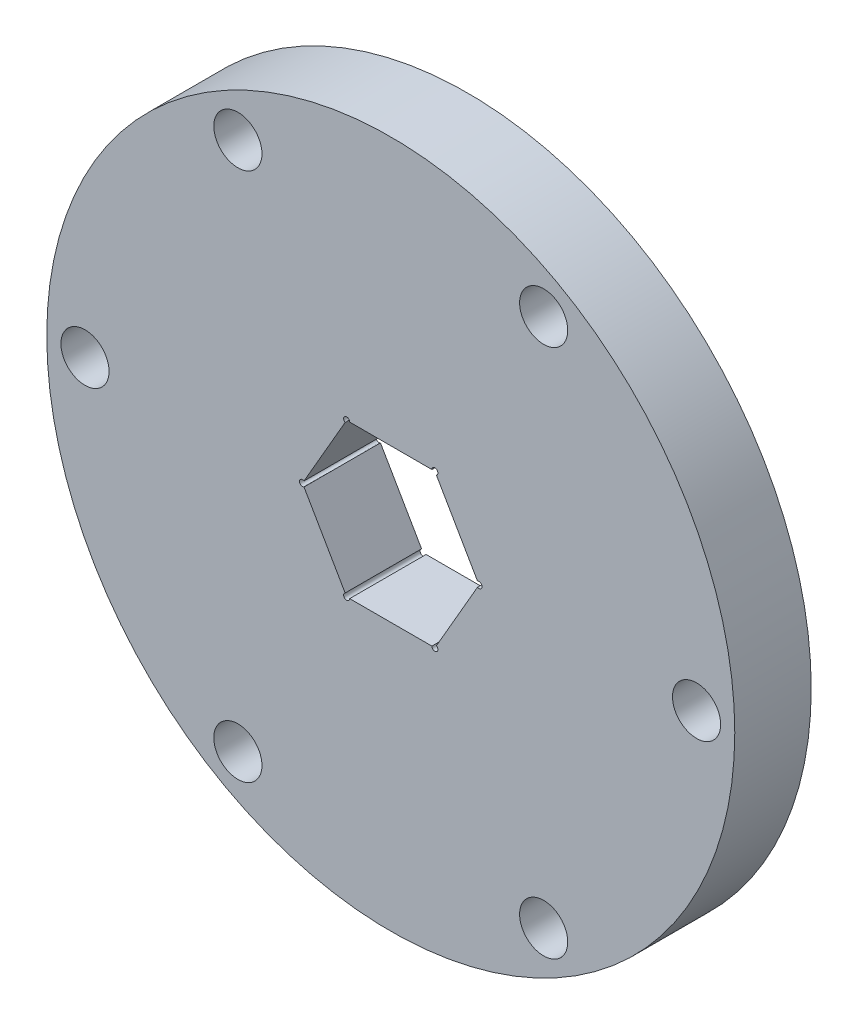
ISO-10303-21;
HEADER;
FILE_DESCRIPTION(('STEP AP214'),'2;1');
FILE_NAME('part.step','',(''),(''),'','','');
FILE_SCHEMA(('AUTOMOTIVE_DESIGN { 1 0 10303 214 1 1 1 1 }'));
ENDSEC;
DATA;
#1=APPLICATION_CONTEXT('core data for automotive mechanical design processes');
#2=APPLICATION_PROTOCOL_DEFINITION('international standard','automotive_design',2000,#1);
#3=PRODUCT_CONTEXT('',#1,'mechanical');
#4=PRODUCT('Part','Part','',(#3));
#5=PRODUCT_RELATED_PRODUCT_CATEGORY('part','',(#4));
#6=PRODUCT_DEFINITION_FORMATION('','',#4);
#7=PRODUCT_DEFINITION_CONTEXT('part definition',#1,'design');
#8=PRODUCT_DEFINITION('design','',#6,#7);
#9=PRODUCT_DEFINITION_SHAPE('','',#8);
#10=(LENGTH_UNIT() NAMED_UNIT(*) SI_UNIT(.MILLI.,.METRE.));
#11=(NAMED_UNIT(*) PLANE_ANGLE_UNIT() SI_UNIT($,.RADIAN.));
#12=(NAMED_UNIT(*) SI_UNIT($,.STERADIAN.) SOLID_ANGLE_UNIT());
#13=UNCERTAINTY_MEASURE_WITH_UNIT(LENGTH_MEASURE(1.E-05),#10,'distance_accuracy_value','');
#14=(GEOMETRIC_REPRESENTATION_CONTEXT(3) GLOBAL_UNCERTAINTY_ASSIGNED_CONTEXT((#13)) GLOBAL_UNIT_ASSIGNED_CONTEXT((#10,
#11,#12)) REPRESENTATION_CONTEXT('',''));
#15=CARTESIAN_POINT('',(0.,0.,0.));
#16=DIRECTION('',(0.,0.,1.));
#17=DIRECTION('',(1.,0.,0.));
#18=AXIS2_PLACEMENT_3D('',#15,#16,#17);
#19=CARTESIAN_POINT('',(3.66617420935412,-6.35,0.));
#20=DIRECTION('',(0.866025403784439,-0.5,0.));
#21=DIRECTION('',(0.5,0.866025403784439,0.));
#22=AXIS2_PLACEMENT_3D('',#19,#20,#21);
#23=PLANE('',#22);
#24=DIRECTION('',(0.5,0.866025403784439,0.));
#25=VECTOR('',#24,1.);
#26=CARTESIAN_POINT('',(3.66617420935412,-6.35,0.));
#27=LINE('',#26,#25);
#28=CARTESIAN_POINT('',(3.7911742093541,-6.13349364905393,0.));
#29=VERTEX_POINT('',#28);
#30=CARTESIAN_POINT('',(7.20734841870823,-0.216506350946134,0.));
#31=VERTEX_POINT('',#30);
#32=EDGE_CURVE('E169',#29,#31,#27,.T.);
#33=ORIENTED_EDGE('',*,*,#32,.F.);
#34=DIRECTION('',(0.,0.,1.));
#35=VECTOR('',#34,1.);
#36=CARTESIAN_POINT('',(3.7911742093541,-6.13349364905393,-6.35));
#37=LINE('',#36,#35);
#38=CARTESIAN_POINT('',(3.7911742093541,-6.13349364905393,6.35));
#39=VERTEX_POINT('',#38);
#40=EDGE_CURVE('E253',#29,#39,#37,.T.);
#41=ORIENTED_EDGE('',*,*,#40,.T.);
#42=DIRECTION('',(-0.5,-0.866025403784439,0.));
#43=VECTOR('',#42,1.);
#44=CARTESIAN_POINT('',(3.66617420935412,-6.35,6.35));
#45=LINE('',#44,#43);
#46=CARTESIAN_POINT('',(7.20734841870823,-0.216506350946135,6.35));
#47=VERTEX_POINT('',#46);
#48=EDGE_CURVE('E162',#47,#39,#45,.T.);
#49=ORIENTED_EDGE('',*,*,#48,.F.);
#50=DIRECTION('',(0.,0.,1.));
#51=VECTOR('',#50,1.);
#52=CARTESIAN_POINT('',(7.20734841870823,-0.216506350946135,-6.35));
#53=LINE('',#52,#51);
#54=EDGE_CURVE('E254',#47,#31,#53,.F.);
#55=ORIENTED_EDGE('',*,*,#54,.T.);
#56=EDGE_LOOP('',(#33,#41,#49,#55));
#57=FACE_BOUND('',#56,.T.);
#58=ADVANCED_FACE('F39',(#57),#23,.F.);
#59=CARTESIAN_POINT('',(-3.66617420935413,-6.35,0.));
#60=DIRECTION('',(0.,-1.,0.));
#61=DIRECTION('',(1.,0.,0.));
#62=AXIS2_PLACEMENT_3D('',#59,#60,#61);
#63=PLANE('',#62);
#64=DIRECTION('',(1.,0.,0.));
#65=VECTOR('',#64,1.);
#66=CARTESIAN_POINT('',(-3.66617420935413,-6.35,0.));
#67=LINE('',#66,#65);
#68=CARTESIAN_POINT('',(-3.41617420935419,-6.35,0.));
#69=VERTEX_POINT('',#68);
#70=CARTESIAN_POINT('',(3.41617420935408,-6.35,0.));
#71=VERTEX_POINT('',#70);
#72=EDGE_CURVE('E215',#69,#71,#67,.T.);
#73=ORIENTED_EDGE('',*,*,#72,.F.);
#74=DIRECTION('',(0.,0.,1.));
#75=VECTOR('',#74,1.);
#76=CARTESIAN_POINT('',(-3.41617420935419,-6.35,-6.35));
#77=LINE('',#76,#75);
#78=CARTESIAN_POINT('',(-3.41617420935419,-6.35,6.35));
#79=VERTEX_POINT('',#78);
#80=EDGE_CURVE('E249',#69,#79,#77,.T.);
#81=ORIENTED_EDGE('',*,*,#80,.T.);
#82=DIRECTION('',(-1.,0.,0.));
#83=VECTOR('',#82,1.);
#84=CARTESIAN_POINT('',(-3.66617420935413,-6.35,6.35));
#85=LINE('',#84,#83);
#86=CARTESIAN_POINT('',(3.41617420935408,-6.35,6.35));
#87=VERTEX_POINT('',#86);
#88=EDGE_CURVE('E159',#87,#79,#85,.T.);
#89=ORIENTED_EDGE('',*,*,#88,.F.);
#90=DIRECTION('',(0.,0.,1.));
#91=VECTOR('',#90,1.);
#92=CARTESIAN_POINT('',(3.41617420935408,-6.35,-6.35));
#93=LINE('',#92,#91);
#94=EDGE_CURVE('E250',#87,#71,#93,.F.);
#95=ORIENTED_EDGE('',*,*,#94,.T.);
#96=EDGE_LOOP('',(#73,#81,#89,#95));
#97=FACE_BOUND('',#96,.T.);
#98=ADVANCED_FACE('F247',(#97),#63,.F.);
#99=CARTESIAN_POINT('',(-7.33234841870825,0.,0.));
#100=DIRECTION('',(-0.866025403784439,-0.5,0.));
#101=DIRECTION('',(0.5,-0.866025403784439,0.));
#102=AXIS2_PLACEMENT_3D('',#99,#100,#101);
#103=PLANE('',#102);
#104=DIRECTION('',(0.5,-0.866025403784439,0.));
#105=VECTOR('',#104,1.);
#106=CARTESIAN_POINT('',(-7.33234841870825,0.,0.));
#107=LINE('',#106,#105);
#108=CARTESIAN_POINT('',(-7.20734841870829,-0.216506350946045,0.));
#109=VERTEX_POINT('',#108);
#110=CARTESIAN_POINT('',(-3.79117420935416,-6.13349364905384,0.));
#111=VERTEX_POINT('',#110);
#112=EDGE_CURVE('E212',#109,#111,#107,.T.);
#113=ORIENTED_EDGE('',*,*,#112,.F.);
#114=DIRECTION('',(0.,0.,1.));
#115=VECTOR('',#114,1.);
#116=CARTESIAN_POINT('',(-7.20734841870829,-0.216506350946045,-6.35));
#117=LINE('',#116,#115);
#118=CARTESIAN_POINT('',(-7.20734841870829,-0.216506350946045,6.35));
#119=VERTEX_POINT('',#118);
#120=EDGE_CURVE('E54',#109,#119,#117,.T.);
#121=ORIENTED_EDGE('',*,*,#120,.T.);
#122=DIRECTION('',(-0.5,0.866025403784439,0.));
#123=VECTOR('',#122,1.);
#124=CARTESIAN_POINT('',(-7.33234841870825,0.,6.35));
#125=LINE('',#124,#123);
#126=CARTESIAN_POINT('',(-3.79117420935416,-6.13349364905384,6.35));
#127=VERTEX_POINT('',#126);
#128=EDGE_CURVE('E151',#127,#119,#125,.T.);
#129=ORIENTED_EDGE('',*,*,#128,.F.);
#130=DIRECTION('',(0.,0.,1.));
#131=VECTOR('',#130,1.);
#132=CARTESIAN_POINT('',(-3.79117420935416,-6.13349364905384,-6.35));
#133=LINE('',#132,#131);
#134=EDGE_CURVE('E257',#127,#111,#133,.F.);
#135=ORIENTED_EDGE('',*,*,#134,.T.);
#136=EDGE_LOOP('',(#113,#121,#129,#135));
#137=FACE_BOUND('',#136,.T.);
#138=ADVANCED_FACE('F296',(#137),#103,.F.);
#139=CARTESIAN_POINT('',(-3.66617420935412,6.35,0.));
#140=DIRECTION('',(-0.866025403784439,0.5,0.));
#141=DIRECTION('',(-0.5,-0.866025403784439,0.));
#142=AXIS2_PLACEMENT_3D('',#139,#140,#141);
#143=PLANE('',#142);
#144=DIRECTION('',(0.5,0.866025403784439,0.));
#145=VECTOR('',#144,1.);
#146=CARTESIAN_POINT('',(-3.66617420935412,6.35,6.35));
#147=LINE('',#146,#145);
#148=CARTESIAN_POINT('',(-7.20734841870821,0.216506350946176,6.35));
#149=VERTEX_POINT('',#148);
#150=CARTESIAN_POINT('',(-3.79117420935412,6.13349364905389,6.35));
#151=VERTEX_POINT('',#150);
#152=EDGE_CURVE('E144',#149,#151,#147,.T.);
#153=ORIENTED_EDGE('',*,*,#152,.F.);
#154=DIRECTION('',(0.,0.,1.));
#155=VECTOR('',#154,1.);
#156=CARTESIAN_POINT('',(-7.20734841870821,0.216506350946176,-6.35));
#157=LINE('',#156,#155);
#158=CARTESIAN_POINT('',(-7.20734841870821,0.216506350946176,0.));
#159=VERTEX_POINT('',#158);
#160=EDGE_CURVE('E153',#149,#159,#157,.F.);
#161=ORIENTED_EDGE('',*,*,#160,.T.);
#162=DIRECTION('',(-0.5,-0.866025403784439,0.));
#163=VECTOR('',#162,1.);
#164=CARTESIAN_POINT('',(-3.66617420935412,6.35,0.));
#165=LINE('',#164,#163);
#166=CARTESIAN_POINT('',(-3.79117420935412,6.13349364905389,0.));
#167=VERTEX_POINT('',#166);
#168=EDGE_CURVE('E209',#167,#159,#165,.T.);
#169=ORIENTED_EDGE('',*,*,#168,.F.);
#170=DIRECTION('',(0.,0.,1.));
#171=VECTOR('',#170,1.);
#172=CARTESIAN_POINT('',(-3.79117420935412,6.13349364905389,-6.35));
#173=LINE('',#172,#171);
#174=EDGE_CURVE('E61',#167,#151,#173,.T.);
#175=ORIENTED_EDGE('',*,*,#174,.T.);
#176=EDGE_LOOP('',(#153,#161,#169,#175));
#177=FACE_BOUND('',#176,.T.);
#178=ADVANCED_FACE('F268',(#177),#143,.F.);
#179=CARTESIAN_POINT('',(3.66617420935412,6.35,0.));
#180=DIRECTION('',(0.,1.,0.));
#181=DIRECTION('',(-1.,0.,0.));
#182=AXIS2_PLACEMENT_3D('',#179,#180,#181);
#183=PLANE('',#182);
#184=DIRECTION('',(-1.,0.,0.));
#185=VECTOR('',#184,1.);
#186=CARTESIAN_POINT('',(3.66617420935412,6.35,0.));
#187=LINE('',#186,#185);
#188=CARTESIAN_POINT('',(3.41617420935414,6.35,0.));
#189=VERTEX_POINT('',#188);
#190=CARTESIAN_POINT('',(-3.41617420935412,6.35,0.));
#191=VERTEX_POINT('',#190);
#192=EDGE_CURVE('E207',#189,#191,#187,.T.);
#193=ORIENTED_EDGE('',*,*,#192,.F.);
#194=DIRECTION('',(0.,0.,1.));
#195=VECTOR('',#194,1.);
#196=CARTESIAN_POINT('',(3.41617420935414,6.35,-6.35));
#197=LINE('',#196,#195);
#198=CARTESIAN_POINT('',(3.41617420935414,6.35,6.35));
#199=VERTEX_POINT('',#198);
#200=EDGE_CURVE('E149',#189,#199,#197,.T.);
#201=ORIENTED_EDGE('',*,*,#200,.T.);
#202=DIRECTION('',(1.,0.,0.));
#203=VECTOR('',#202,1.);
#204=CARTESIAN_POINT('',(3.66617420935412,6.35,6.35));
#205=LINE('',#204,#203);
#206=CARTESIAN_POINT('',(-3.41617420935412,6.35,6.35));
#207=VERTEX_POINT('',#206);
#208=EDGE_CURVE('E142',#207,#199,#205,.T.);
#209=ORIENTED_EDGE('',*,*,#208,.F.);
#210=DIRECTION('',(0.,0.,1.));
#211=VECTOR('',#210,1.);
#212=CARTESIAN_POINT('',(-3.41617420935412,6.35,-6.35));
#213=LINE('',#212,#211);
#214=EDGE_CURVE('E125',#207,#191,#213,.F.);
#215=ORIENTED_EDGE('',*,*,#214,.T.);
#216=EDGE_LOOP('',(#193,#201,#209,#215));
#217=FACE_BOUND('',#216,.T.);
#218=ADVANCED_FACE('F148',(#217),#183,.F.);
#219=CARTESIAN_POINT('',(7.33234841870824,0.,0.));
#220=DIRECTION('',(0.866025403784439,0.5,0.));
#221=DIRECTION('',(-0.5,0.866025403784439,0.));
#222=AXIS2_PLACEMENT_3D('',#219,#220,#221);
#223=PLANE('',#222);
#224=DIRECTION('',(-0.5,0.866025403784439,0.));
#225=VECTOR('',#224,1.);
#226=CARTESIAN_POINT('',(7.33234841870824,0.,0.));
#227=LINE('',#226,#225);
#228=CARTESIAN_POINT('',(7.20734841870826,0.216506350946081,0.));
#229=VERTEX_POINT('',#228);
#230=CARTESIAN_POINT('',(3.79117420935413,6.13349364905388,0.));
#231=VERTEX_POINT('',#230);
#232=EDGE_CURVE('E204',#229,#231,#227,.T.);
#233=ORIENTED_EDGE('',*,*,#232,.F.);
#234=DIRECTION('',(0.,0.,1.));
#235=VECTOR('',#234,1.);
#236=CARTESIAN_POINT('',(7.20734841870826,0.216506350946081,-6.35));
#237=LINE('',#236,#235);
#238=CARTESIAN_POINT('',(7.20734841870826,0.216506350946081,6.35));
#239=VERTEX_POINT('',#238);
#240=EDGE_CURVE('E260',#229,#239,#237,.T.);
#241=ORIENTED_EDGE('',*,*,#240,.T.);
#242=DIRECTION('',(0.5,-0.866025403784439,0.));
#243=VECTOR('',#242,1.);
#244=CARTESIAN_POINT('',(7.33234841870824,0.,6.35));
#245=LINE('',#244,#243);
#246=CARTESIAN_POINT('',(3.79117420935413,6.13349364905388,6.35));
#247=VERTEX_POINT('',#246);
#248=EDGE_CURVE('E222',#247,#239,#245,.T.);
#249=ORIENTED_EDGE('',*,*,#248,.F.);
#250=DIRECTION('',(0.,0.,1.));
#251=VECTOR('',#250,1.);
#252=CARTESIAN_POINT('',(3.79117420935413,6.13349364905388,-6.35));
#253=LINE('',#252,#251);
#254=EDGE_CURVE('E273',#247,#231,#253,.F.);
#255=ORIENTED_EDGE('',*,*,#254,.T.);
#256=EDGE_LOOP('',(#233,#241,#249,#255));
#257=FACE_BOUND('',#256,.T.);
#258=ADVANCED_FACE('F276',(#257),#223,.F.);
#259=CARTESIAN_POINT('',(0.,0.,6.35));
#260=DIRECTION('',(0.,0.,-1.));
#261=DIRECTION('',(-1.,0.,0.));
#262=AXIS2_PLACEMENT_3D('',#259,#260,#261);
#263=CYLINDRICAL_SURFACE('',#262,28.575);
#264=CARTESIAN_POINT('',(0.,0.,6.35));
#265=DIRECTION('',(0.,0.,1.));
#266=DIRECTION('',(1.,0.,0.));
#267=AXIS2_PLACEMENT_3D('',#264,#265,#266);
#268=CIRCLE('',#267,28.575);
#269=CARTESIAN_POINT('',(28.575,0.,6.35));
#270=VERTEX_POINT('',#269);
#271=EDGE_CURVE('E219',#270,#270,#268,.T.);
#272=ORIENTED_EDGE('',*,*,#271,.F.);
#273=EDGE_LOOP('',(#272));
#274=FACE_BOUND('',#273,.T.);
#275=CARTESIAN_POINT('',(0.,0.,0.));
#276=DIRECTION('',(0.,0.,1.));
#277=DIRECTION('',(1.,0.,0.));
#278=AXIS2_PLACEMENT_3D('',#275,#276,#277);
#279=CIRCLE('',#278,28.575);
#280=CARTESIAN_POINT('',(28.575,0.,0.));
#281=VERTEX_POINT('',#280);
#282=EDGE_CURVE('E218',#281,#281,#279,.T.);
#283=ORIENTED_EDGE('',*,*,#282,.T.);
#284=EDGE_LOOP('',(#283));
#285=FACE_BOUND('',#284,.T.);
#286=ADVANCED_FACE('F41',(#274,#285),#263,.T.);
#287=CARTESIAN_POINT('',(0.,0.,6.35));
#288=DIRECTION('',(0.,0.,1.));
#289=DIRECTION('',(1.,0.,0.));
#290=AXIS2_PLACEMENT_3D('',#287,#288,#289);
#291=PLANE('',#290);
#292=CARTESIAN_POINT('',(-7.33234841870825,0.,6.35));
#293=DIRECTION('',(0.,0.,1.));
#294=DIRECTION('',(1.,0.,0.));
#295=AXIS2_PLACEMENT_3D('',#292,#293,#294);
#296=CIRCLE('',#295,0.25);
#297=EDGE_CURVE('E292',#149,#119,#296,.T.);
#298=ORIENTED_EDGE('',*,*,#297,.F.);
#299=ORIENTED_EDGE('',*,*,#152,.T.);
#300=CARTESIAN_POINT('',(-3.66617420935412,6.35,6.35));
#301=DIRECTION('',(0.,0.,1.));
#302=DIRECTION('',(1.,0.,0.));
#303=AXIS2_PLACEMENT_3D('',#300,#301,#302);
#304=CIRCLE('',#303,0.25);
#305=EDGE_CURVE('E128',#207,#151,#304,.T.);
#306=ORIENTED_EDGE('',*,*,#305,.F.);
#307=ORIENTED_EDGE('',*,*,#208,.T.);
#308=CARTESIAN_POINT('',(3.66617420935414,6.34999999999999,6.35));
#309=DIRECTION('',(0.,0.,1.));
#310=DIRECTION('',(1.,0.,0.));
#311=AXIS2_PLACEMENT_3D('',#308,#309,#310);
#312=CIRCLE('',#311,0.25);
#313=EDGE_CURVE('E145',#247,#199,#312,.T.);
#314=ORIENTED_EDGE('',*,*,#313,.F.);
#315=ORIENTED_EDGE('',*,*,#248,.T.);
#316=CARTESIAN_POINT('',(7.33234841870825,0.,6.35));
#317=DIRECTION('',(0.,0.,1.));
#318=DIRECTION('',(1.,0.,0.));
#319=AXIS2_PLACEMENT_3D('',#316,#317,#318);
#320=CIRCLE('',#319,0.25);
#321=EDGE_CURVE('E283',#47,#239,#320,.T.);
#322=ORIENTED_EDGE('',*,*,#321,.F.);
#323=ORIENTED_EDGE('',*,*,#48,.T.);
#324=CARTESIAN_POINT('',(3.66617420935408,-6.35000000000003,6.35));
#325=DIRECTION('',(0.,0.,1.));
#326=DIRECTION('',(1.,0.,0.));
#327=AXIS2_PLACEMENT_3D('',#324,#325,#326);
#328=CIRCLE('',#327,0.25);
#329=EDGE_CURVE('E286',#87,#39,#328,.T.);
#330=ORIENTED_EDGE('',*,*,#329,.F.);
#331=ORIENTED_EDGE('',*,*,#88,.T.);
#332=CARTESIAN_POINT('',(-3.66617420935419,-6.34999999999997,6.35));
#333=DIRECTION('',(0.,0.,1.));
#334=DIRECTION('',(1.,0.,0.));
#335=AXIS2_PLACEMENT_3D('',#332,#333,#334);
#336=CIRCLE('',#335,0.249999999999999);
#337=EDGE_CURVE('E290',#127,#79,#336,.T.);
#338=ORIENTED_EDGE('',*,*,#337,.F.);
#339=ORIENTED_EDGE('',*,*,#128,.T.);
#340=EDGE_LOOP('',(#298,#299,#306,#307,#314,#315,#322,#323,#330,#331,#338,#339));
#341=FACE_BOUND('',#340,.T.);
#342=CARTESIAN_POINT('',(25.4,0.,6.35));
#343=DIRECTION('',(0.,0.,1.));
#344=DIRECTION('',(1.,0.,0.));
#345=AXIS2_PLACEMENT_3D('',#342,#343,#344);
#346=CIRCLE('',#345,2.);
#347=CARTESIAN_POINT('',(27.4,0.,6.35));
#348=VERTEX_POINT('',#347);
#349=EDGE_CURVE('E170',#348,#348,#346,.T.);
#350=ORIENTED_EDGE('',*,*,#349,.F.);
#351=EDGE_LOOP('',(#350));
#352=FACE_BOUND('',#351,.T.);
#353=CARTESIAN_POINT('',(12.7000000000003,21.9970452561246,6.35));
#354=DIRECTION('',(0.,0.,1.));
#355=DIRECTION('',(1.,0.,0.));
#356=AXIS2_PLACEMENT_3D('',#353,#354,#355);
#357=CIRCLE('',#356,2.);
#358=CARTESIAN_POINT('',(14.7000000000003,21.9970452561246,6.35));
#359=VERTEX_POINT('',#358);
#360=EDGE_CURVE('E174',#359,#359,#357,.T.);
#361=ORIENTED_EDGE('',*,*,#360,.F.);
#362=EDGE_LOOP('',(#361));
#363=FACE_BOUND('',#362,.T.);
#364=CARTESIAN_POINT('',(-12.6999999999998,21.9970452561249,6.35));
#365=DIRECTION('',(0.,0.,1.));
#366=DIRECTION('',(1.,0.,0.));
#367=AXIS2_PLACEMENT_3D('',#364,#365,#366);
#368=CIRCLE('',#367,2.);
#369=CARTESIAN_POINT('',(-10.6999999999998,21.9970452561249,6.35));
#370=VERTEX_POINT('',#369);
#371=EDGE_CURVE('E197',#370,#370,#368,.T.);
#372=ORIENTED_EDGE('',*,*,#371,.F.);
#373=EDGE_LOOP('',(#372));
#374=FACE_BOUND('',#373,.T.);
#375=CARTESIAN_POINT('',(-25.4,1.77367252013231E-13,6.35));
#376=DIRECTION('',(0.,0.,1.));
#377=DIRECTION('',(1.,0.,0.));
#378=AXIS2_PLACEMENT_3D('',#375,#376,#377);
#379=CIRCLE('',#378,2.);
#380=CARTESIAN_POINT('',(-23.4,1.77367252013231E-13,6.35));
#381=VERTEX_POINT('',#380);
#382=EDGE_CURVE('E191',#381,#381,#379,.T.);
#383=ORIENTED_EDGE('',*,*,#382,.F.);
#384=EDGE_LOOP('',(#383));
#385=FACE_BOUND('',#384,.T.);
#386=CARTESIAN_POINT('',(-12.7000000000001,-21.9970452561247,6.35));
#387=DIRECTION('',(0.,0.,1.));
#388=DIRECTION('',(1.,0.,0.));
#389=AXIS2_PLACEMENT_3D('',#386,#387,#388);
#390=CIRCLE('',#389,2.);
#391=CARTESIAN_POINT('',(-10.7000000000001,-21.9970452561247,6.35));
#392=VERTEX_POINT('',#391);
#393=EDGE_CURVE('E185',#392,#392,#390,.T.);
#394=ORIENTED_EDGE('',*,*,#393,.F.);
#395=EDGE_LOOP('',(#394));
#396=FACE_BOUND('',#395,.T.);
#397=CARTESIAN_POINT('',(12.6999999999999,-21.9970452561248,6.35));
#398=DIRECTION('',(0.,0.,1.));
#399=DIRECTION('',(1.,0.,0.));
#400=AXIS2_PLACEMENT_3D('',#397,#398,#399);
#401=CIRCLE('',#400,2.);
#402=CARTESIAN_POINT('',(14.6999999999999,-21.9970452561248,6.35));
#403=VERTEX_POINT('',#402);
#404=EDGE_CURVE('E173',#403,#403,#401,.T.);
#405=ORIENTED_EDGE('',*,*,#404,.F.);
#406=EDGE_LOOP('',(#405));
#407=FACE_BOUND('',#406,.T.);
#408=ORIENTED_EDGE('',*,*,#271,.T.);
#409=EDGE_LOOP('',(#408));
#410=FACE_BOUND('',#409,.T.);
#411=ADVANCED_FACE('F139',(#341,#352,#363,#374,#385,#396,#407,#410),#291,.T.);
#412=CARTESIAN_POINT('',(0.,0.,0.));
#413=DIRECTION('',(0.,0.,1.));
#414=DIRECTION('',(1.,0.,0.));
#415=AXIS2_PLACEMENT_3D('',#412,#413,#414);
#416=PLANE('',#415);
#417=CARTESIAN_POINT('',(25.4,0.,0.));
#418=DIRECTION('',(0.,0.,1.));
#419=DIRECTION('',(1.,0.,0.));
#420=AXIS2_PLACEMENT_3D('',#417,#418,#419);
#421=CIRCLE('',#420,2.);
#422=CARTESIAN_POINT('',(27.4,0.,0.));
#423=VERTEX_POINT('',#422);
#424=EDGE_CURVE('E166',#423,#423,#421,.T.);
#425=ORIENTED_EDGE('',*,*,#424,.T.);
#426=EDGE_LOOP('',(#425));
#427=FACE_BOUND('',#426,.T.);
#428=CARTESIAN_POINT('',(12.7000000000003,21.9970452561246,0.));
#429=DIRECTION('',(0.,0.,1.));
#430=DIRECTION('',(1.,0.,0.));
#431=AXIS2_PLACEMENT_3D('',#428,#429,#430);
#432=CIRCLE('',#431,2.);
#433=CARTESIAN_POINT('',(14.7000000000003,21.9970452561246,0.));
#434=VERTEX_POINT('',#433);
#435=EDGE_CURVE('E165',#434,#434,#432,.T.);
#436=ORIENTED_EDGE('',*,*,#435,.T.);
#437=EDGE_LOOP('',(#436));
#438=FACE_BOUND('',#437,.T.);
#439=CARTESIAN_POINT('',(-12.6999999999998,21.9970452561249,0.));
#440=DIRECTION('',(0.,0.,1.));
#441=DIRECTION('',(1.,0.,0.));
#442=AXIS2_PLACEMENT_3D('',#439,#440,#441);
#443=CIRCLE('',#442,2.);
#444=CARTESIAN_POINT('',(-10.6999999999998,21.9970452561249,0.));
#445=VERTEX_POINT('',#444);
#446=EDGE_CURVE('E177',#445,#445,#443,.T.);
#447=ORIENTED_EDGE('',*,*,#446,.T.);
#448=EDGE_LOOP('',(#447));
#449=FACE_BOUND('',#448,.T.);
#450=CARTESIAN_POINT('',(-25.4,1.77367252013231E-13,0.));
#451=DIRECTION('',(0.,0.,1.));
#452=DIRECTION('',(1.,0.,0.));
#453=AXIS2_PLACEMENT_3D('',#450,#451,#452);
#454=CIRCLE('',#453,2.);
#455=CARTESIAN_POINT('',(-23.4,1.77367252013231E-13,0.));
#456=VERTEX_POINT('',#455);
#457=EDGE_CURVE('E194',#456,#456,#454,.T.);
#458=ORIENTED_EDGE('',*,*,#457,.T.);
#459=EDGE_LOOP('',(#458));
#460=FACE_BOUND('',#459,.T.);
#461=CARTESIAN_POINT('',(-12.7000000000001,-21.9970452561247,0.));
#462=DIRECTION('',(0.,0.,1.));
#463=DIRECTION('',(1.,0.,0.));
#464=AXIS2_PLACEMENT_3D('',#461,#462,#463);
#465=CIRCLE('',#464,2.);
#466=CARTESIAN_POINT('',(-10.7000000000001,-21.9970452561247,0.));
#467=VERTEX_POINT('',#466);
#468=EDGE_CURVE('E188',#467,#467,#465,.T.);
#469=ORIENTED_EDGE('',*,*,#468,.T.);
#470=EDGE_LOOP('',(#469));
#471=FACE_BOUND('',#470,.T.);
#472=CARTESIAN_POINT('',(12.6999999999999,-21.9970452561248,0.));
#473=DIRECTION('',(0.,0.,1.));
#474=DIRECTION('',(1.,0.,0.));
#475=AXIS2_PLACEMENT_3D('',#472,#473,#474);
#476=CIRCLE('',#475,2.);
#477=CARTESIAN_POINT('',(14.6999999999999,-21.9970452561248,0.));
#478=VERTEX_POINT('',#477);
#479=EDGE_CURVE('E182',#478,#478,#476,.T.);
#480=ORIENTED_EDGE('',*,*,#479,.T.);
#481=EDGE_LOOP('',(#480));
#482=FACE_BOUND('',#481,.T.);
#483=ORIENTED_EDGE('',*,*,#168,.T.);
#484=CARTESIAN_POINT('',(-7.33234841870825,0.,0.));
#485=DIRECTION('',(0.,0.,1.));
#486=DIRECTION('',(1.,0.,0.));
#487=AXIS2_PLACEMENT_3D('',#484,#485,#486);
#488=CIRCLE('',#487,0.25);
#489=EDGE_CURVE('E11',#159,#109,#488,.T.);
#490=ORIENTED_EDGE('',*,*,#489,.T.);
#491=ORIENTED_EDGE('',*,*,#112,.T.);
#492=CARTESIAN_POINT('',(-3.66617420935419,-6.34999999999997,0.));
#493=DIRECTION('',(0.,0.,1.));
#494=DIRECTION('',(1.,0.,0.));
#495=AXIS2_PLACEMENT_3D('',#492,#493,#494);
#496=CIRCLE('',#495,0.249999999999999);
#497=EDGE_CURVE('E47',#111,#69,#496,.T.);
#498=ORIENTED_EDGE('',*,*,#497,.T.);
#499=ORIENTED_EDGE('',*,*,#72,.T.);
#500=CARTESIAN_POINT('',(3.66617420935408,-6.35000000000003,0.));
#501=DIRECTION('',(0.,0.,1.));
#502=DIRECTION('',(1.,0.,0.));
#503=AXIS2_PLACEMENT_3D('',#500,#501,#502);
#504=CIRCLE('',#503,0.25);
#505=EDGE_CURVE('E234',#71,#29,#504,.T.);
#506=ORIENTED_EDGE('',*,*,#505,.T.);
#507=ORIENTED_EDGE('',*,*,#32,.T.);
#508=CARTESIAN_POINT('',(7.33234841870825,0.,0.));
#509=DIRECTION('',(0.,0.,1.));
#510=DIRECTION('',(1.,0.,0.));
#511=AXIS2_PLACEMENT_3D('',#508,#509,#510);
#512=CIRCLE('',#511,0.25);
#513=EDGE_CURVE('E231',#31,#229,#512,.T.);
#514=ORIENTED_EDGE('',*,*,#513,.T.);
#515=ORIENTED_EDGE('',*,*,#232,.T.);
#516=CARTESIAN_POINT('',(3.66617420935414,6.34999999999999,0.));
#517=DIRECTION('',(0.,0.,1.));
#518=DIRECTION('',(1.,0.,0.));
#519=AXIS2_PLACEMENT_3D('',#516,#517,#518);
#520=CIRCLE('',#519,0.25);
#521=EDGE_CURVE('E228',#231,#189,#520,.T.);
#522=ORIENTED_EDGE('',*,*,#521,.T.);
#523=ORIENTED_EDGE('',*,*,#192,.T.);
#524=CARTESIAN_POINT('',(-3.66617420935412,6.35,0.));
#525=DIRECTION('',(0.,0.,1.));
#526=DIRECTION('',(1.,0.,0.));
#527=AXIS2_PLACEMENT_3D('',#524,#525,#526);
#528=CIRCLE('',#527,0.25);
#529=EDGE_CURVE('E129',#191,#167,#528,.T.);
#530=ORIENTED_EDGE('',*,*,#529,.T.);
#531=EDGE_LOOP('',(#483,#490,#491,#498,#499,#506,#507,#514,#515,#522,#523,#530));
#532=FACE_BOUND('',#531,.T.);
#533=ORIENTED_EDGE('',*,*,#282,.F.);
#534=EDGE_LOOP('',(#533));
#535=FACE_BOUND('',#534,.T.);
#536=ADVANCED_FACE('F239',(#427,#438,#449,#460,#471,#482,#532,#535),#416,.F.);
#537=CARTESIAN_POINT('',(12.6999999999999,-21.9970452561248,0.));
#538=DIRECTION('',(0.,0.,1.));
#539=DIRECTION('',(1.,0.,0.));
#540=AXIS2_PLACEMENT_3D('',#537,#538,#539);
#541=CYLINDRICAL_SURFACE('',#540,2.);
#542=ORIENTED_EDGE('',*,*,#479,.F.);
#543=EDGE_LOOP('',(#542));
#544=FACE_BOUND('',#543,.T.);
#545=ORIENTED_EDGE('',*,*,#404,.T.);
#546=EDGE_LOOP('',(#545));
#547=FACE_BOUND('',#546,.T.);
#548=ADVANCED_FACE('F323',(#544,#547),#541,.F.);
#549=CARTESIAN_POINT('',(-12.7000000000001,-21.9970452561247,0.));
#550=DIRECTION('',(0.,0.,1.));
#551=DIRECTION('',(1.,0.,0.));
#552=AXIS2_PLACEMENT_3D('',#549,#550,#551);
#553=CYLINDRICAL_SURFACE('',#552,2.);
#554=ORIENTED_EDGE('',*,*,#468,.F.);
#555=EDGE_LOOP('',(#554));
#556=FACE_BOUND('',#555,.T.);
#557=ORIENTED_EDGE('',*,*,#393,.T.);
#558=EDGE_LOOP('',(#557));
#559=FACE_BOUND('',#558,.T.);
#560=ADVANCED_FACE('F329',(#556,#559),#553,.F.);
#561=CARTESIAN_POINT('',(-25.4,1.77367252013231E-13,0.));
#562=DIRECTION('',(0.,0.,1.));
#563=DIRECTION('',(1.,0.,0.));
#564=AXIS2_PLACEMENT_3D('',#561,#562,#563);
#565=CYLINDRICAL_SURFACE('',#564,2.);
#566=ORIENTED_EDGE('',*,*,#457,.F.);
#567=EDGE_LOOP('',(#566));
#568=FACE_BOUND('',#567,.T.);
#569=ORIENTED_EDGE('',*,*,#382,.T.);
#570=EDGE_LOOP('',(#569));
#571=FACE_BOUND('',#570,.T.);
#572=ADVANCED_FACE('F369',(#568,#571),#565,.F.);
#573=CARTESIAN_POINT('',(-12.6999999999998,21.9970452561249,0.));
#574=DIRECTION('',(0.,0.,1.));
#575=DIRECTION('',(1.,0.,0.));
#576=AXIS2_PLACEMENT_3D('',#573,#574,#575);
#577=CYLINDRICAL_SURFACE('',#576,2.);
#578=ORIENTED_EDGE('',*,*,#446,.F.);
#579=EDGE_LOOP('',(#578));
#580=FACE_BOUND('',#579,.T.);
#581=ORIENTED_EDGE('',*,*,#371,.T.);
#582=EDGE_LOOP('',(#581));
#583=FACE_BOUND('',#582,.T.);
#584=ADVANCED_FACE('F365',(#580,#583),#577,.F.);
#585=CARTESIAN_POINT('',(12.7000000000003,21.9970452561246,0.));
#586=DIRECTION('',(0.,0.,1.));
#587=DIRECTION('',(1.,0.,0.));
#588=AXIS2_PLACEMENT_3D('',#585,#586,#587);
#589=CYLINDRICAL_SURFACE('',#588,2.);
#590=ORIENTED_EDGE('',*,*,#435,.F.);
#591=EDGE_LOOP('',(#590));
#592=FACE_BOUND('',#591,.T.);
#593=ORIENTED_EDGE('',*,*,#360,.T.);
#594=EDGE_LOOP('',(#593));
#595=FACE_BOUND('',#594,.T.);
#596=ADVANCED_FACE('F368',(#592,#595),#589,.F.);
#597=CARTESIAN_POINT('',(25.4,0.,0.));
#598=DIRECTION('',(0.,0.,1.));
#599=DIRECTION('',(1.,0.,0.));
#600=AXIS2_PLACEMENT_3D('',#597,#598,#599);
#601=CYLINDRICAL_SURFACE('',#600,2.);
#602=ORIENTED_EDGE('',*,*,#424,.F.);
#603=EDGE_LOOP('',(#602));
#604=FACE_BOUND('',#603,.T.);
#605=ORIENTED_EDGE('',*,*,#349,.T.);
#606=EDGE_LOOP('',(#605));
#607=FACE_BOUND('',#606,.T.);
#608=ADVANCED_FACE('F379',(#604,#607),#601,.F.);
#609=CARTESIAN_POINT('',(-3.66617420935412,6.35,-6.35));
#610=DIRECTION('',(0.,0.,1.));
#611=DIRECTION('',(1.,0.,0.));
#612=AXIS2_PLACEMENT_3D('',#609,#610,#611);
#613=CYLINDRICAL_SURFACE('',#612,0.25);
#614=ORIENTED_EDGE('',*,*,#529,.F.);
#615=ORIENTED_EDGE('',*,*,#214,.F.);
#616=ORIENTED_EDGE('',*,*,#305,.T.);
#617=ORIENTED_EDGE('',*,*,#174,.F.);
#618=EDGE_LOOP('',(#614,#615,#616,#617));
#619=FACE_BOUND('',#618,.T.);
#620=ADVANCED_FACE('F127',(#619),#613,.F.);
#621=CARTESIAN_POINT('',(3.66617420935414,6.34999999999999,-6.35));
#622=DIRECTION('',(0.,0.,1.));
#623=DIRECTION('',(1.,0.,0.));
#624=AXIS2_PLACEMENT_3D('',#621,#622,#623);
#625=CYLINDRICAL_SURFACE('',#624,0.25);
#626=ORIENTED_EDGE('',*,*,#521,.F.);
#627=ORIENTED_EDGE('',*,*,#254,.F.);
#628=ORIENTED_EDGE('',*,*,#313,.T.);
#629=ORIENTED_EDGE('',*,*,#200,.F.);
#630=EDGE_LOOP('',(#626,#627,#628,#629));
#631=FACE_BOUND('',#630,.T.);
#632=ADVANCED_FACE('F272',(#631),#625,.F.);
#633=CARTESIAN_POINT('',(7.33234841870825,0.,-6.35));
#634=DIRECTION('',(0.,0.,1.));
#635=DIRECTION('',(1.,0.,0.));
#636=AXIS2_PLACEMENT_3D('',#633,#634,#635);
#637=CYLINDRICAL_SURFACE('',#636,0.25);
#638=ORIENTED_EDGE('',*,*,#321,.T.);
#639=ORIENTED_EDGE('',*,*,#240,.F.);
#640=ORIENTED_EDGE('',*,*,#513,.F.);
#641=ORIENTED_EDGE('',*,*,#54,.F.);
#642=EDGE_LOOP('',(#638,#639,#640,#641));
#643=FACE_BOUND('',#642,.T.);
#644=ADVANCED_FACE('F307',(#643),#637,.F.);
#645=CARTESIAN_POINT('',(3.66617420935408,-6.35000000000003,-6.35));
#646=DIRECTION('',(0.,0.,1.));
#647=DIRECTION('',(1.,0.,0.));
#648=AXIS2_PLACEMENT_3D('',#645,#646,#647);
#649=CYLINDRICAL_SURFACE('',#648,0.25);
#650=ORIENTED_EDGE('',*,*,#505,.F.);
#651=ORIENTED_EDGE('',*,*,#94,.F.);
#652=ORIENTED_EDGE('',*,*,#329,.T.);
#653=ORIENTED_EDGE('',*,*,#40,.F.);
#654=EDGE_LOOP('',(#650,#651,#652,#653));
#655=FACE_BOUND('',#654,.T.);
#656=ADVANCED_FACE('F300',(#655),#649,.F.);
#657=CARTESIAN_POINT('',(-3.66617420935419,-6.34999999999997,-6.35));
#658=DIRECTION('',(0.,0.,1.));
#659=DIRECTION('',(1.,0.,0.));
#660=AXIS2_PLACEMENT_3D('',#657,#658,#659);
#661=CYLINDRICAL_SURFACE('',#660,0.249999999999999);
#662=ORIENTED_EDGE('',*,*,#497,.F.);
#663=ORIENTED_EDGE('',*,*,#134,.F.);
#664=ORIENTED_EDGE('',*,*,#337,.T.);
#665=ORIENTED_EDGE('',*,*,#80,.F.);
#666=EDGE_LOOP('',(#662,#663,#664,#665));
#667=FACE_BOUND('',#666,.T.);
#668=ADVANCED_FACE('F298',(#667),#661,.F.);
#669=CARTESIAN_POINT('',(-7.33234841870825,0.,-6.35));
#670=DIRECTION('',(0.,0.,1.));
#671=DIRECTION('',(1.,0.,0.));
#672=AXIS2_PLACEMENT_3D('',#669,#670,#671);
#673=CYLINDRICAL_SURFACE('',#672,0.25);
#674=ORIENTED_EDGE('',*,*,#489,.F.);
#675=ORIENTED_EDGE('',*,*,#160,.F.);
#676=ORIENTED_EDGE('',*,*,#297,.T.);
#677=ORIENTED_EDGE('',*,*,#120,.F.);
#678=EDGE_LOOP('',(#674,#675,#676,#677));
#679=FACE_BOUND('',#678,.T.);
#680=ADVANCED_FACE('F293',(#679),#673,.F.);
#681=CLOSED_SHELL('',(#58,#98,#138,#178,#218,#258,#286,#411,#536,#548,#560,#572,#584,#596,#608,
#620,#632,#644,#656,#668,#680));
#682=MANIFOLD_SOLID_BREP('B2',#681);
#683=ADVANCED_BREP_SHAPE_REPRESENTATION('',(#18,#682),#14);
#684=SHAPE_DEFINITION_REPRESENTATION(#9,#683);
ENDSEC;
END-ISO-10303-21;
